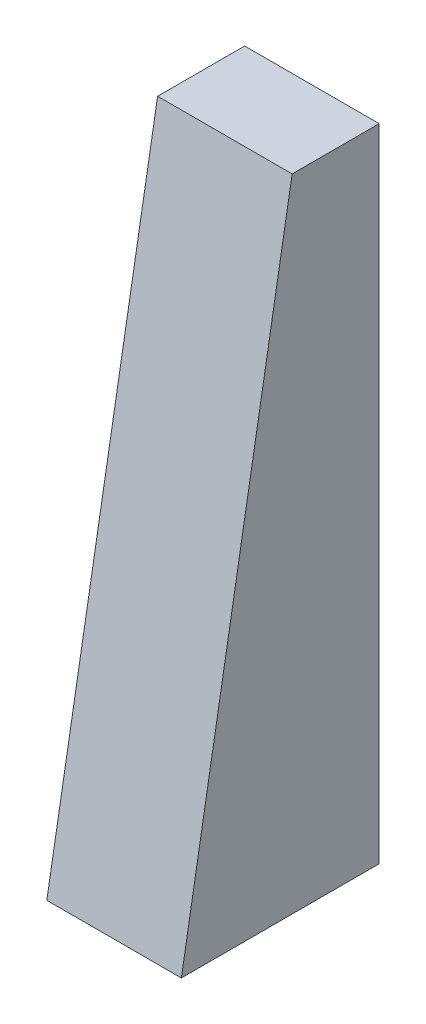
ISO-10303-21;
HEADER;
FILE_DESCRIPTION(('STEP AP214'),'2;1');
FILE_NAME('part.step','',(''),(''),'','','');
FILE_SCHEMA(('AUTOMOTIVE_DESIGN { 1 0 10303 214 1 1 1 1 }'));
ENDSEC;
DATA;
#1=APPLICATION_CONTEXT('core data for automotive mechanical design processes');
#2=APPLICATION_PROTOCOL_DEFINITION('international standard','automotive_design',2000,#1);
#3=PRODUCT_CONTEXT('',#1,'mechanical');
#4=PRODUCT('Part','Part','',(#3));
#5=PRODUCT_RELATED_PRODUCT_CATEGORY('part','',(#4));
#6=PRODUCT_DEFINITION_FORMATION('','',#4);
#7=PRODUCT_DEFINITION_CONTEXT('part definition',#1,'design');
#8=PRODUCT_DEFINITION('design','',#6,#7);
#9=PRODUCT_DEFINITION_SHAPE('','',#8);
#10=(LENGTH_UNIT() NAMED_UNIT(*) SI_UNIT(.MILLI.,.METRE.));
#11=(NAMED_UNIT(*) PLANE_ANGLE_UNIT() SI_UNIT($,.RADIAN.));
#12=(NAMED_UNIT(*) SI_UNIT($,.STERADIAN.) SOLID_ANGLE_UNIT());
#13=UNCERTAINTY_MEASURE_WITH_UNIT(LENGTH_MEASURE(1.E-05),#10,'distance_accuracy_value','');
#14=(GEOMETRIC_REPRESENTATION_CONTEXT(3) GLOBAL_UNCERTAINTY_ASSIGNED_CONTEXT((#13)) GLOBAL_UNIT_ASSIGNED_CONTEXT((#10,
#11,#12)) REPRESENTATION_CONTEXT('',''));
#15=CARTESIAN_POINT('',(0.,0.,0.));
#16=DIRECTION('',(0.,0.,1.));
#17=DIRECTION('',(1.,0.,0.));
#18=AXIS2_PLACEMENT_3D('',#15,#16,#17);
#19=CARTESIAN_POINT('',(170.,0.,250.));
#20=DIRECTION('',(0.,1.,0.));
#21=DIRECTION('',(0.,0.,1.));
#22=AXIS2_PLACEMENT_3D('',#19,#20,#21);
#23=PLANE('',#22);
#24=DIRECTION('',(0.,0.,-1.));
#25=VECTOR('',#24,1.);
#26=CARTESIAN_POINT('',(0.,0.,250.));
#27=LINE('',#26,#25);
#28=CARTESIAN_POINT('',(0.,0.,250.));
#29=VERTEX_POINT('',#28);
#30=CARTESIAN_POINT('',(0.,0.,0.));
#31=VERTEX_POINT('',#30);
#32=EDGE_CURVE('E96',#29,#31,#27,.T.);
#33=ORIENTED_EDGE('',*,*,#32,.T.);
#34=DIRECTION('',(-1.,0.,0.));
#35=VECTOR('',#34,1.);
#36=CARTESIAN_POINT('',(170.,0.,0.));
#37=LINE('',#36,#35);
#38=CARTESIAN_POINT('',(170.,0.,0.));
#39=VERTEX_POINT('',#38);
#40=EDGE_CURVE('E11',#39,#31,#37,.T.);
#41=ORIENTED_EDGE('',*,*,#40,.F.);
#42=DIRECTION('',(0.,0.,-1.));
#43=VECTOR('',#42,1.);
#44=CARTESIAN_POINT('',(170.,0.,250.));
#45=LINE('',#44,#43);
#46=CARTESIAN_POINT('',(170.,0.,250.));
#47=VERTEX_POINT('',#46);
#48=EDGE_CURVE('E84',#47,#39,#45,.T.);
#49=ORIENTED_EDGE('',*,*,#48,.F.);
#50=DIRECTION('',(-1.,0.,0.));
#51=VECTOR('',#50,1.);
#52=CARTESIAN_POINT('',(170.,0.,250.));
#53=LINE('',#52,#51);
#54=EDGE_CURVE('E92',#47,#29,#53,.T.);
#55=ORIENTED_EDGE('',*,*,#54,.T.);
#56=EDGE_LOOP('',(#33,#41,#49,#55));
#57=FACE_BOUND('',#56,.T.);
#58=ADVANCED_FACE('F33',(#57),#23,.F.);
#59=CARTESIAN_POINT('',(170.,0.,0.));
#60=DIRECTION('',(0.,0.,1.));
#61=DIRECTION('',(1.,0.,0.));
#62=AXIS2_PLACEMENT_3D('',#59,#60,#61);
#63=PLANE('',#62);
#64=DIRECTION('',(0.,1.,0.));
#65=VECTOR('',#64,1.);
#66=CARTESIAN_POINT('',(0.,0.,0.));
#67=LINE('',#66,#65);
#68=CARTESIAN_POINT('',(0.,810.,0.));
#69=VERTEX_POINT('',#68);
#70=EDGE_CURVE('E88',#31,#69,#67,.T.);
#71=ORIENTED_EDGE('',*,*,#70,.T.);
#72=DIRECTION('',(-1.,0.,0.));
#73=VECTOR('',#72,1.);
#74=CARTESIAN_POINT('',(170.,810.,0.));
#75=LINE('',#74,#73);
#76=CARTESIAN_POINT('',(170.,810.,0.));
#77=VERTEX_POINT('',#76);
#78=EDGE_CURVE('E41',#77,#69,#75,.T.);
#79=ORIENTED_EDGE('',*,*,#78,.F.);
#80=DIRECTION('',(0.,1.,0.));
#81=VECTOR('',#80,1.);
#82=CARTESIAN_POINT('',(170.,0.,0.));
#83=LINE('',#82,#81);
#84=EDGE_CURVE('E79',#39,#77,#83,.T.);
#85=ORIENTED_EDGE('',*,*,#84,.F.);
#86=ORIENTED_EDGE('',*,*,#40,.T.);
#87=EDGE_LOOP('',(#71,#79,#85,#86));
#88=FACE_BOUND('',#87,.T.);
#89=ADVANCED_FACE('F87',(#88),#63,.F.);
#90=CARTESIAN_POINT('',(170.,810.,0.));
#91=DIRECTION('',(0.,-1.,0.));
#92=DIRECTION('',(0.,0.,-1.));
#93=AXIS2_PLACEMENT_3D('',#90,#91,#92);
#94=PLANE('',#93);
#95=DIRECTION('',(0.,0.,1.));
#96=VECTOR('',#95,1.);
#97=CARTESIAN_POINT('',(0.,810.,0.));
#98=LINE('',#97,#96);
#99=CARTESIAN_POINT('',(0.,810.,110.));
#100=VERTEX_POINT('',#99);
#101=EDGE_CURVE('E66',#69,#100,#98,.T.);
#102=ORIENTED_EDGE('',*,*,#101,.T.);
#103=DIRECTION('',(-1.,0.,0.));
#104=VECTOR('',#103,1.);
#105=CARTESIAN_POINT('',(170.,810.,110.));
#106=LINE('',#105,#104);
#107=CARTESIAN_POINT('',(170.,810.,110.));
#108=VERTEX_POINT('',#107);
#109=EDGE_CURVE('E89',#108,#100,#106,.T.);
#110=ORIENTED_EDGE('',*,*,#109,.F.);
#111=DIRECTION('',(0.,0.,1.));
#112=VECTOR('',#111,1.);
#113=CARTESIAN_POINT('',(170.,810.,0.));
#114=LINE('',#113,#112);
#115=EDGE_CURVE('E82',#77,#108,#114,.T.);
#116=ORIENTED_EDGE('',*,*,#115,.F.);
#117=ORIENTED_EDGE('',*,*,#78,.T.);
#118=EDGE_LOOP('',(#102,#110,#116,#117));
#119=FACE_BOUND('',#118,.T.);
#120=ADVANCED_FACE('F90',(#119),#94,.F.);
#121=CARTESIAN_POINT('',(170.,810.,110.));
#122=DIRECTION('',(0.,-0.170314285218807,-0.985389793051667));
#123=DIRECTION('',(0.,0.985389793051667,-0.170314285218807));
#124=AXIS2_PLACEMENT_3D('',#121,#122,#123);
#125=PLANE('',#124);
#126=DIRECTION('',(0.,-0.985389793051667,0.170314285218807));
#127=VECTOR('',#126,1.);
#128=CARTESIAN_POINT('',(0.,810.,110.));
#129=LINE('',#128,#127);
#130=EDGE_CURVE('E72',#100,#29,#129,.T.);
#131=ORIENTED_EDGE('',*,*,#130,.T.);
#132=ORIENTED_EDGE('',*,*,#54,.F.);
#133=DIRECTION('',(0.,-0.985389793051667,0.170314285218807));
#134=VECTOR('',#133,1.);
#135=CARTESIAN_POINT('',(170.,810.,110.));
#136=LINE('',#135,#134);
#137=EDGE_CURVE('E49',#108,#47,#136,.T.);
#138=ORIENTED_EDGE('',*,*,#137,.F.);
#139=ORIENTED_EDGE('',*,*,#109,.T.);
#140=EDGE_LOOP('',(#131,#132,#138,#139));
#141=FACE_BOUND('',#140,.T.);
#142=ADVANCED_FACE('F103',(#141),#125,.F.);
#143=CARTESIAN_POINT('',(170.,0.,0.));
#144=DIRECTION('',(1.,0.,0.));
#145=DIRECTION('',(0.,0.,-1.));
#146=AXIS2_PLACEMENT_3D('',#143,#144,#145);
#147=PLANE('',#146);
#148=ORIENTED_EDGE('',*,*,#48,.T.);
#149=ORIENTED_EDGE('',*,*,#84,.T.);
#150=ORIENTED_EDGE('',*,*,#115,.T.);
#151=ORIENTED_EDGE('',*,*,#137,.T.);
#152=EDGE_LOOP('',(#148,#149,#150,#151));
#153=FACE_BOUND('',#152,.T.);
#154=ADVANCED_FACE('F80',(#153),#147,.T.);
#155=CARTESIAN_POINT('',(0.,0.,0.));
#156=DIRECTION('',(1.,0.,0.));
#157=DIRECTION('',(0.,0.,-1.));
#158=AXIS2_PLACEMENT_3D('',#155,#156,#157);
#159=PLANE('',#158);
#160=ORIENTED_EDGE('',*,*,#32,.F.);
#161=ORIENTED_EDGE('',*,*,#130,.F.);
#162=ORIENTED_EDGE('',*,*,#101,.F.);
#163=ORIENTED_EDGE('',*,*,#70,.F.);
#164=EDGE_LOOP('',(#160,#161,#162,#163));
#165=FACE_BOUND('',#164,.T.);
#166=ADVANCED_FACE('F106',(#165),#159,.F.);
#167=CLOSED_SHELL('',(#58,#89,#120,#142,#154,#166));
#168=MANIFOLD_SOLID_BREP('B2',#167);
#169=ADVANCED_BREP_SHAPE_REPRESENTATION('',(#18,#168),#14);
#170=SHAPE_DEFINITION_REPRESENTATION(#9,#169);
ENDSEC;
END-ISO-10303-21;
